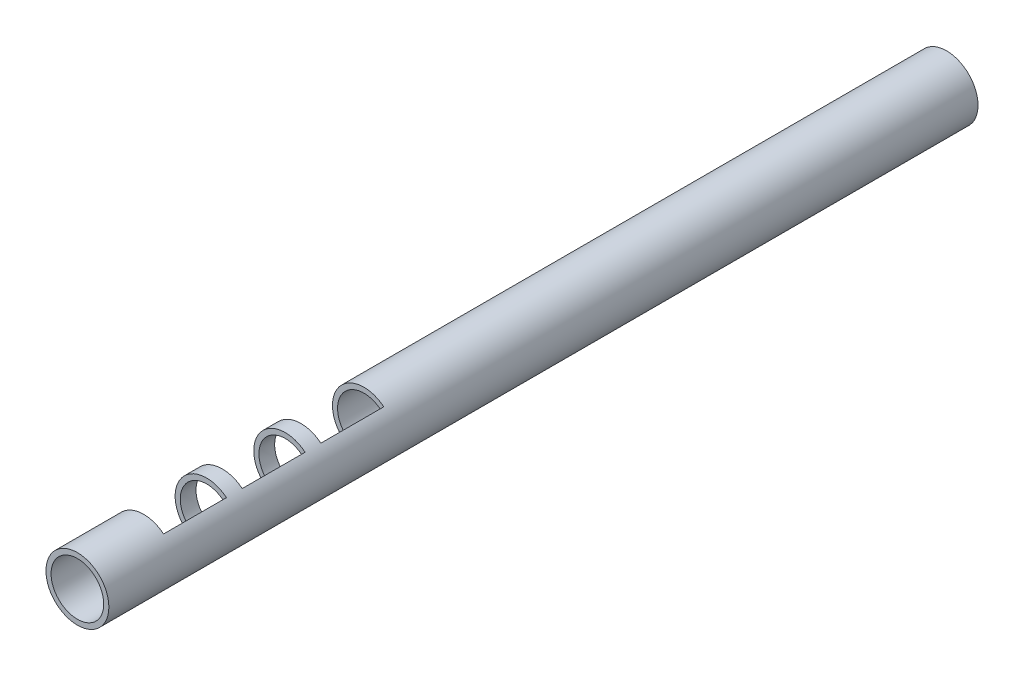
ISO-10303-21;
HEADER;
FILE_DESCRIPTION(('STEP AP214'),'2;1');
FILE_NAME('part.step','',(''),(''),'','','');
FILE_SCHEMA(('AUTOMOTIVE_DESIGN { 1 0 10303 214 1 1 1 1 }'));
ENDSEC;
DATA;
#1=APPLICATION_CONTEXT('core data for automotive mechanical design processes');
#2=APPLICATION_PROTOCOL_DEFINITION('international standard','automotive_design',2000,#1);
#3=PRODUCT_CONTEXT('',#1,'mechanical');
#4=PRODUCT('Part','Part','',(#3));
#5=PRODUCT_RELATED_PRODUCT_CATEGORY('part','',(#4));
#6=PRODUCT_DEFINITION_FORMATION('','',#4);
#7=PRODUCT_DEFINITION_CONTEXT('part definition',#1,'design');
#8=PRODUCT_DEFINITION('design','',#6,#7);
#9=PRODUCT_DEFINITION_SHAPE('','',#8);
#10=(LENGTH_UNIT() NAMED_UNIT(*) SI_UNIT(.MILLI.,.METRE.));
#11=(NAMED_UNIT(*) PLANE_ANGLE_UNIT() SI_UNIT($,.RADIAN.));
#12=(NAMED_UNIT(*) SI_UNIT($,.STERADIAN.) SOLID_ANGLE_UNIT());
#13=UNCERTAINTY_MEASURE_WITH_UNIT(LENGTH_MEASURE(1.E-05),#10,'distance_accuracy_value','');
#14=(GEOMETRIC_REPRESENTATION_CONTEXT(3) GLOBAL_UNCERTAINTY_ASSIGNED_CONTEXT((#13)) GLOBAL_UNIT_ASSIGNED_CONTEXT((#10,
#11,#12)) REPRESENTATION_CONTEXT('',''));
#15=CARTESIAN_POINT('',(0.,0.,0.));
#16=DIRECTION('',(0.,0.,1.));
#17=DIRECTION('',(1.,0.,0.));
#18=AXIS2_PLACEMENT_3D('',#15,#16,#17);
#19=CARTESIAN_POINT('',(0.393200000000001,0.481952030808046,2.488));
#20=DIRECTION('',(-0.774842493260524,0.632154340836013,0.));
#21=DIRECTION('',(0.,0.,1.));
#22=AXIS2_PLACEMENT_3D('',#19,#20,#21);
#23=PLANE('',#22);
#24=DIRECTION('',(0.632154340836013,0.774842493260524,0.));
#25=VECTOR('',#24,1.);
#26=CARTESIAN_POINT('',(0.393200000000001,0.481952030808046,1.866));
#27=LINE('',#26,#25);
#28=CARTESIAN_POINT('',(0.329108400000001,0.403393849786335,1.866));
#29=VERTEX_POINT('',#28);
#30=CARTESIAN_POINT('',(0.393200000000001,0.481952030808046,1.866));
#31=VERTEX_POINT('',#30);
#32=EDGE_CURVE('E11',#29,#31,#27,.T.);
#33=ORIENTED_EDGE('',*,*,#32,.F.);
#34=DIRECTION('',(0.,0.,1.));
#35=VECTOR('',#34,1.);
#36=CARTESIAN_POINT('',(0.329108400000001,0.403393849786335,1.555));
#37=LINE('',#36,#35);
#38=CARTESIAN_POINT('',(0.329108400000001,0.403393849786335,3.11));
#39=VERTEX_POINT('',#38);
#40=EDGE_CURVE('E293',#29,#39,#37,.T.);
#41=ORIENTED_EDGE('',*,*,#40,.T.);
#42=DIRECTION('',(0.632154340836013,0.774842493260524,0.));
#43=VECTOR('',#42,1.);
#44=CARTESIAN_POINT('',(0.393200000000001,0.481952030808046,3.11));
#45=LINE('',#44,#43);
#46=CARTESIAN_POINT('',(0.393200000000001,0.481952030808046,3.11));
#47=VERTEX_POINT('',#46);
#48=EDGE_CURVE('E48',#39,#47,#45,.T.);
#49=ORIENTED_EDGE('',*,*,#48,.T.);
#50=DIRECTION('',(0.,0.,1.));
#51=VECTOR('',#50,1.);
#52=CARTESIAN_POINT('',(0.393200000000001,0.481952030808046,1.555));
#53=LINE('',#52,#51);
#54=EDGE_CURVE('E283',#31,#47,#53,.T.);
#55=ORIENTED_EDGE('',*,*,#54,.F.);
#56=EDGE_LOOP('',(#33,#41,#49,#55));
#57=FACE_BOUND('',#56,.T.);
#58=ADVANCED_FACE('F40',(#57),#23,.T.);
#59=CARTESIAN_POINT('',(0.,0.,3.11));
#60=DIRECTION('',(0.,0.,1.));
#61=DIRECTION('',(1.,0.,0.));
#62=AXIS2_PLACEMENT_3D('',#59,#60,#61);
#63=PLANE('',#62);
#64=ORIENTED_EDGE('',*,*,#48,.F.);
#65=CARTESIAN_POINT('',(0.,0.,3.11));
#66=DIRECTION('',(0.,0.,1.));
#67=DIRECTION('',(1.,0.,0.));
#68=AXIS2_PLACEMENT_3D('',#65,#66,#67);
#69=CIRCLE('',#68,0.520614);
#70=CARTESIAN_POINT('',(0.329108400000001,-0.403393849786335,3.11));
#71=VERTEX_POINT('',#70);
#72=EDGE_CURVE('E290',#39,#71,#69,.T.);
#73=ORIENTED_EDGE('',*,*,#72,.T.);
#74=DIRECTION('',(0.632154340836013,-0.774842493260524,0.));
#75=VECTOR('',#74,1.);
#76=CARTESIAN_POINT('',(0.3932,-0.481952030808046,3.11));
#77=LINE('',#76,#75);
#78=CARTESIAN_POINT('',(0.3932,-0.481952030808046,3.11));
#79=VERTEX_POINT('',#78);
#80=EDGE_CURVE('E173',#71,#79,#77,.T.);
#81=ORIENTED_EDGE('',*,*,#80,.T.);
#82=CARTESIAN_POINT('',(0.,0.,3.11));
#83=DIRECTION('',(0.,0.,-1.));
#84=DIRECTION('',(-1.,0.,0.));
#85=AXIS2_PLACEMENT_3D('',#82,#83,#84);
#86=CIRCLE('',#85,0.622);
#87=EDGE_CURVE('E278',#47,#79,#86,.F.);
#88=ORIENTED_EDGE('',*,*,#87,.F.);
#89=EDGE_LOOP('',(#64,#73,#81,#88));
#90=FACE_BOUND('',#89,.T.);
#91=ADVANCED_FACE('F238',(#90),#63,.F.);
#92=CARTESIAN_POINT('',(0.,0.,3.421));
#93=DIRECTION('',(0.,0.,-1.));
#94=DIRECTION('',(-1.,0.,0.));
#95=AXIS2_PLACEMENT_3D('',#92,#93,#94);
#96=PLANE('',#95);
#97=DIRECTION('',(0.632154340836013,0.774842493260524,0.));
#98=VECTOR('',#97,1.);
#99=CARTESIAN_POINT('',(0.393200000000001,0.481952030808046,3.421));
#100=LINE('',#99,#98);
#101=CARTESIAN_POINT('',(0.329108400000001,0.403393849786335,3.421));
#102=VERTEX_POINT('',#101);
#103=CARTESIAN_POINT('',(0.393200000000001,0.481952030808046,3.421));
#104=VERTEX_POINT('',#103);
#105=EDGE_CURVE('E265',#102,#104,#100,.T.);
#106=ORIENTED_EDGE('',*,*,#105,.T.);
#107=CARTESIAN_POINT('',(0.,0.,3.421));
#108=DIRECTION('',(0.,0.,1.));
#109=DIRECTION('',(1.,0.,0.));
#110=AXIS2_PLACEMENT_3D('',#107,#108,#109);
#111=CIRCLE('',#110,0.622);
#112=CARTESIAN_POINT('',(0.393200000000001,-0.481952030808046,3.421));
#113=VERTEX_POINT('',#112);
#114=EDGE_CURVE('E279',#104,#113,#111,.T.);
#115=ORIENTED_EDGE('',*,*,#114,.T.);
#116=DIRECTION('',(0.632154340836013,-0.774842493260524,0.));
#117=VECTOR('',#116,1.);
#118=CARTESIAN_POINT('',(0.393200000000001,-0.481952030808046,3.421));
#119=LINE('',#118,#117);
#120=CARTESIAN_POINT('',(0.329108400000001,-0.403393849786335,3.421));
#121=VERTEX_POINT('',#120);
#122=EDGE_CURVE('E149',#121,#113,#119,.T.);
#123=ORIENTED_EDGE('',*,*,#122,.F.);
#124=CARTESIAN_POINT('',(0.,0.,3.421));
#125=DIRECTION('',(0.,0.,1.));
#126=DIRECTION('',(1.,0.,0.));
#127=AXIS2_PLACEMENT_3D('',#124,#125,#126);
#128=CIRCLE('',#127,0.520614);
#129=EDGE_CURVE('E276',#102,#121,#128,.T.);
#130=ORIENTED_EDGE('',*,*,#129,.F.);
#131=EDGE_LOOP('',(#106,#115,#123,#130));
#132=FACE_BOUND('',#131,.T.);
#133=ADVANCED_FACE('F243',(#132),#96,.F.);
#134=CARTESIAN_POINT('',(0.,0.,1.555));
#135=DIRECTION('',(0.,0.,-1.));
#136=DIRECTION('',(-1.,0.,0.));
#137=AXIS2_PLACEMENT_3D('',#134,#135,#136);
#138=PLANE('',#137);
#139=DIRECTION('',(0.632154340836013,0.774842493260524,0.));
#140=VECTOR('',#139,1.);
#141=CARTESIAN_POINT('',(0.3932,0.481952030808046,1.555));
#142=LINE('',#141,#140);
#143=CARTESIAN_POINT('',(0.3291084,0.403393849786335,1.555));
#144=VERTEX_POINT('',#143);
#145=CARTESIAN_POINT('',(0.3932,0.481952030808046,1.555));
#146=VERTEX_POINT('',#145);
#147=EDGE_CURVE('E252',#144,#146,#142,.T.);
#148=ORIENTED_EDGE('',*,*,#147,.F.);
#149=CARTESIAN_POINT('',(0.,0.,1.555));
#150=DIRECTION('',(0.,0.,1.));
#151=DIRECTION('',(1.,0.,0.));
#152=AXIS2_PLACEMENT_3D('',#149,#150,#151);
#153=CIRCLE('',#152,0.520614);
#154=CARTESIAN_POINT('',(0.3291084,-0.403393849786335,1.555));
#155=VERTEX_POINT('',#154);
#156=EDGE_CURVE('E254',#144,#155,#153,.T.);
#157=ORIENTED_EDGE('',*,*,#156,.T.);
#158=DIRECTION('',(0.632154340836013,-0.774842493260524,0.));
#159=VECTOR('',#158,1.);
#160=CARTESIAN_POINT('',(0.3932,-0.481952030808046,1.555));
#161=LINE('',#160,#159);
#162=CARTESIAN_POINT('',(0.3932,-0.481952030808046,1.555));
#163=VERTEX_POINT('',#162);
#164=EDGE_CURVE('E162',#155,#163,#161,.T.);
#165=ORIENTED_EDGE('',*,*,#164,.T.);
#166=CARTESIAN_POINT('',(0.,0.,1.555));
#167=DIRECTION('',(0.,0.,1.));
#168=DIRECTION('',(1.,0.,0.));
#169=AXIS2_PLACEMENT_3D('',#166,#167,#168);
#170=CIRCLE('',#169,0.622);
#171=EDGE_CURVE('E63',#146,#163,#170,.T.);
#172=ORIENTED_EDGE('',*,*,#171,.F.);
#173=EDGE_LOOP('',(#148,#157,#165,#172));
#174=FACE_BOUND('',#173,.T.);
#175=ADVANCED_FACE('F234',(#174),#138,.T.);
#176=CARTESIAN_POINT('',(0.,0.,1.866));
#177=DIRECTION('',(0.,0.,-1.));
#178=DIRECTION('',(-1.,0.,0.));
#179=AXIS2_PLACEMENT_3D('',#176,#177,#178);
#180=PLANE('',#179);
#181=CARTESIAN_POINT('',(0.,0.,1.866));
#182=DIRECTION('',(0.,0.,1.));
#183=DIRECTION('',(1.,0.,0.));
#184=AXIS2_PLACEMENT_3D('',#181,#182,#183);
#185=CIRCLE('',#184,0.520614);
#186=CARTESIAN_POINT('',(0.329108400000001,-0.403393849786335,1.866));
#187=VERTEX_POINT('',#186);
#188=EDGE_CURVE('E281',#187,#29,#185,.F.);
#189=ORIENTED_EDGE('',*,*,#188,.T.);
#190=ORIENTED_EDGE('',*,*,#32,.T.);
#191=CARTESIAN_POINT('',(0.,0.,1.866));
#192=DIRECTION('',(0.,0.,1.));
#193=DIRECTION('',(1.,0.,0.));
#194=AXIS2_PLACEMENT_3D('',#191,#192,#193);
#195=CIRCLE('',#194,0.622);
#196=CARTESIAN_POINT('',(0.3932,-0.481952030808046,1.866));
#197=VERTEX_POINT('',#196);
#198=EDGE_CURVE('E286',#197,#31,#195,.F.);
#199=ORIENTED_EDGE('',*,*,#198,.F.);
#200=DIRECTION('',(0.632154340836013,-0.774842493260524,0.));
#201=VECTOR('',#200,1.);
#202=CARTESIAN_POINT('',(0.3932,-0.481952030808046,1.866));
#203=LINE('',#202,#201);
#204=EDGE_CURVE('E178',#187,#197,#203,.T.);
#205=ORIENTED_EDGE('',*,*,#204,.F.);
#206=EDGE_LOOP('',(#189,#190,#199,#205));
#207=FACE_BOUND('',#206,.T.);
#208=ADVANCED_FACE('F42',(#207),#180,.F.);
#209=CARTESIAN_POINT('',(0.,0.,1.555));
#210=DIRECTION('',(0.,0.,1.));
#211=DIRECTION('',(1.,0.,0.));
#212=AXIS2_PLACEMENT_3D('',#209,#210,#211);
#213=CYLINDRICAL_SURFACE('',#212,0.622);
#214=CARTESIAN_POINT('',(-0.622,0.,5.365));
#215=CARTESIAN_POINT('',(-0.621999577929827,0.0109193633288384,5.36499939308507));
#216=CARTESIAN_POINT('',(-0.621709329938002,0.0218502270294628,5.36410161503432));
#217=CARTESIAN_POINT('',(-0.620578112855119,0.043402443202015,5.36054010866013));
#218=CARTESIAN_POINT('',(-0.619736207669612,0.0540232374685384,5.35787337854731));
#219=CARTESIAN_POINT('',(-0.617593869971351,0.0746246518911457,5.35087419082279));
#220=CARTESIAN_POINT('',(-0.61629445041236,0.0846066291781811,5.34654541114978));
#221=CARTESIAN_POINT('',(-0.613370888019472,0.103699386181399,5.33635803819557));
#222=CARTESIAN_POINT('',(-0.61174679129765,0.112810289340036,5.33049966211826));
#223=CARTESIAN_POINT('',(-0.608286102372987,0.130203719158426,5.31721765206123));
#224=CARTESIAN_POINT('',(-0.606444663928166,0.138453985198494,5.30975303528527));
#225=CARTESIAN_POINT('',(-0.602784240920798,0.153610144329198,5.29355730894605));
#226=CARTESIAN_POINT('',(-0.600965262165017,0.160515696300347,5.28482587900247));
#227=CARTESIAN_POINT('',(-0.597503530771228,0.172963818804697,5.26606209326497));
#228=CARTESIAN_POINT('',(-0.595866696764658,0.178465603211153,5.25600148309368));
#229=CARTESIAN_POINT('',(-0.59302745289626,0.187685596399211,5.23503670826931));
#230=CARTESIAN_POINT('',(-0.591824918677886,0.191404315840203,5.22413278617599));
#231=CARTESIAN_POINT('',(-0.590041030843826,0.196833859126492,5.20215455937567));
#232=CARTESIAN_POINT('',(-0.589441214579351,0.198604530142794,5.19109658086054));
#233=CARTESIAN_POINT('',(-0.588875945894283,0.200274737992444,5.16882547613999));
#234=CARTESIAN_POINT('',(-0.588910313539342,0.200174805564169,5.15761239484344));
#235=CARTESIAN_POINT('',(-0.589593281584499,0.198153311328795,5.13585096574481));
#236=CARTESIAN_POINT('',(-0.590215937903085,0.196308688318,5.12529451770902));
#237=CARTESIAN_POINT('',(-0.591963052928186,0.190975230611652,5.10464966713253));
#238=CARTESIAN_POINT('',(-0.593087570309906,0.187486203657547,5.09456131947219));
#239=CARTESIAN_POINT('',(-0.595731017518543,0.178910257031213,5.07495920845102));
#240=CARTESIAN_POINT('',(-0.597255714099061,0.173799725062295,5.06545658672679));
#241=CARTESIAN_POINT('',(-0.600525069528976,0.162142523518303,5.0474194725291));
#242=CARTESIAN_POINT('',(-0.602269776064023,0.155595542374402,5.0388851907008));
#243=CARTESIAN_POINT('',(-0.605885585651293,0.140878299077213,5.02259381155107));
#244=CARTESIAN_POINT('',(-0.607758727443434,0.132645000236177,5.01489400937032));
#245=CARTESIAN_POINT('',(-0.611347152244487,0.114977401877551,5.0009672538188));
#246=CARTESIAN_POINT('',(-0.613062366497891,0.105542583485076,4.9947409401126));
#247=CARTESIAN_POINT('',(-0.616161845004992,0.0856218640392364,4.98389576386483));
#248=CARTESIAN_POINT('',(-0.617542856982662,0.0751269410421367,4.97929251303983));
#249=CARTESIAN_POINT('',(-0.619792686366072,0.0534683769053928,4.9719420636265));
#250=CARTESIAN_POINT('',(-0.620662554643341,0.0423061601262106,4.96919105526121));
#251=CARTESIAN_POINT('',(-0.62148320570485,0.025868383558992,4.96661195013316));
#252=CARTESIAN_POINT('',(-0.621676438455422,0.020715991613797,4.966008193597));
#253=CARTESIAN_POINT('',(-0.621934936052818,0.0103765990587502,4.96520207383045));
#254=CARTESIAN_POINT('',(-0.62200020059546,0.00518959836666256,4.96499971155417));
#255=CARTESIAN_POINT('',(-0.621999577929833,-0.0109193633288352,4.96500060691491));
#256=CARTESIAN_POINT('',(-0.621709329938004,-0.0218502270294587,4.96589838496567));
#257=CARTESIAN_POINT('',(-0.620578112855117,-0.0434024432020111,4.96945989133987));
#258=CARTESIAN_POINT('',(-0.619736207669612,-0.0540232374685353,4.97212662145269));
#259=CARTESIAN_POINT('',(-0.617593869971351,-0.0746246518911438,4.97912580917721));
#260=CARTESIAN_POINT('',(-0.616294450412361,-0.0846066291781794,4.98345458885022));
#261=CARTESIAN_POINT('',(-0.613370888019472,-0.103699386181397,4.99364196180443));
#262=CARTESIAN_POINT('',(-0.611746791297651,-0.112810289340035,4.99950033788174));
#263=CARTESIAN_POINT('',(-0.608286102372988,-0.130203719158423,5.01278234793877));
#264=CARTESIAN_POINT('',(-0.606444663928166,-0.138453985198492,5.02024696471472));
#265=CARTESIAN_POINT('',(-0.602784240920798,-0.153610144329196,5.03644269105395));
#266=CARTESIAN_POINT('',(-0.600965262165017,-0.160515696300345,5.04517412099753));
#267=CARTESIAN_POINT('',(-0.597503530771229,-0.172963818804695,5.06393790673503));
#268=CARTESIAN_POINT('',(-0.595866696764659,-0.178465603211152,5.07399851690632));
#269=CARTESIAN_POINT('',(-0.59302745289626,-0.187685596399211,5.09496329173069));
#270=CARTESIAN_POINT('',(-0.591824918677886,-0.191404315840202,5.10586721382401));
#271=CARTESIAN_POINT('',(-0.590041030843827,-0.196833859126491,5.12784544062432));
#272=CARTESIAN_POINT('',(-0.589441214579351,-0.198604530142794,5.13890341913945));
#273=CARTESIAN_POINT('',(-0.588875945894283,-0.200274737992444,5.16117452386001));
#274=CARTESIAN_POINT('',(-0.588910313539342,-0.200174805564169,5.17238760515656));
#275=CARTESIAN_POINT('',(-0.589593281584499,-0.198153311328795,5.19414903425519));
#276=CARTESIAN_POINT('',(-0.590215937903085,-0.196308688318,5.20470548229097));
#277=CARTESIAN_POINT('',(-0.591963052928186,-0.190975230611653,5.22535033286746));
#278=CARTESIAN_POINT('',(-0.593087570309906,-0.187486203657547,5.2354386805278));
#279=CARTESIAN_POINT('',(-0.595731017518542,-0.178910257031214,5.25504079154898));
#280=CARTESIAN_POINT('',(-0.597255714099061,-0.173799725062295,5.26454341327321));
#281=CARTESIAN_POINT('',(-0.600525069528976,-0.162142523518304,5.2825805274709));
#282=CARTESIAN_POINT('',(-0.602269776064022,-0.155595542374403,5.29111480929919));
#283=CARTESIAN_POINT('',(-0.605885585651293,-0.140878299077215,5.30740618844893));
#284=CARTESIAN_POINT('',(-0.607758727443433,-0.132645000236179,5.31510599062967));
#285=CARTESIAN_POINT('',(-0.611347152244487,-0.114977401877553,5.3290327461812));
#286=CARTESIAN_POINT('',(-0.61306236649789,-0.105542583485078,5.3352590598874));
#287=CARTESIAN_POINT('',(-0.616161845004992,-0.0856218640392379,5.34610423613517));
#288=CARTESIAN_POINT('',(-0.617542856982662,-0.0751269410421379,5.35070748696017));
#289=CARTESIAN_POINT('',(-0.619792686366072,-0.0534683769053939,5.3580579363735));
#290=CARTESIAN_POINT('',(-0.62066255464334,-0.042306160126212,5.36080894473879));
#291=CARTESIAN_POINT('',(-0.62148320570485,-0.0258683835589934,5.36338804986684));
#292=CARTESIAN_POINT('',(-0.621676438455423,-0.0207159916137979,5.363991806403));
#293=CARTESIAN_POINT('',(-0.621934936052818,-0.0103765990587498,5.36479792616955));
#294=CARTESIAN_POINT('',(-0.622000200595457,-0.00518959836666111,5.36500028844582));
#295=CARTESIAN_POINT('',(-0.622,0.,5.365));
#296=B_SPLINE_CURVE_WITH_KNOTS('',3,(#214,#215,#216,#217,#218,#219,#220,#221,#222,#223,#224,
#225,#226,#227,#228,#229,#230,#231,#232,#233,#234,#235,#236,#237,#238,#239,#240,#241,#242,#243,
#244,#245,#246,#247,#248,#249,#250,#251,#252,#253,#254,#255,#256,#257,#258,#259,#260,#261,#262,
#263,#264,#265,#266,#267,#268,#269,#270,#271,#272,#273,#274,#275,#276,#277,#278,#279,#280,#281,
#282,#283,#284,#285,#286,#287,#288,#289,#290,#291,#292,#293,#294,#295),.UNSPECIFIED.,.T.,.F.,(4,
2,2,2,2,2,2,2,2,2,2,2,2,2,2,2,2,2,2,2,2,2,2,2,2,2,2,2,2,2,2,2,2,2,2,2,2,2,2,2,4),(0.,
0.0327380856553519,0.065531868183564,0.0982534959600799,0.130970479764623,0.16465009229773,
0.198338237386977,0.232915564706205,0.26748298335722,0.300955906343576,0.334419332343535,
0.366472648404575,0.398529712968828,0.431076848275395,0.463631050114923,0.497754520395143,
0.531892777149168,0.566350973681965,0.600738076718819,0.61629732746276,0.631856615191184,
0.664594700846535,0.697388483374749,0.730110111151266,0.762827094955808,0.796506707488914,
0.830194852578161,0.864772179897391,0.899339598548406,0.932812521534762,0.96627594753472,
0.998329263595761,1.03038632816001,1.06293346346658,1.09548766530611,1.12961113558633,
1.16374939234035,1.19820758887315,1.23259469191,1.24815394265395,1.26371323038237),.UNSPECIFIED.);
#297=CARTESIAN_POINT('',(-0.622,0.,5.365));
#298=VERTEX_POINT('',#297);
#299=EDGE_CURVE('E188',#298,#298,#296,.T.);
#300=ORIENTED_EDGE('',*,*,#299,.F.);
#301=EDGE_LOOP('',(#300));
#302=FACE_BOUND('',#301,.T.);
#303=DIRECTION('',(0.,0.,1.));
#304=VECTOR('',#303,1.);
#305=CARTESIAN_POINT('',(0.393200000000001,-0.481952030808046,3.11));
#306=LINE('',#305,#304);
#307=CARTESIAN_POINT('',(0.393200000000001,-0.481952030808046,4.665));
#308=VERTEX_POINT('',#307);
#309=EDGE_CURVE('E137',#113,#308,#306,.T.);
#310=ORIENTED_EDGE('',*,*,#309,.F.);
#311=ORIENTED_EDGE('',*,*,#114,.F.);
#312=DIRECTION('',(0.,0.,1.));
#313=VECTOR('',#312,1.);
#314=CARTESIAN_POINT('',(0.393200000000001,0.481952030808046,3.11));
#315=LINE('',#314,#313);
#316=CARTESIAN_POINT('',(0.393200000000001,0.481952030808046,4.665));
#317=VERTEX_POINT('',#316);
#318=EDGE_CURVE('E139',#104,#317,#315,.T.);
#319=ORIENTED_EDGE('',*,*,#318,.T.);
#320=CARTESIAN_POINT('',(0.,0.,4.665));
#321=DIRECTION('',(0.,0.,-1.));
#322=DIRECTION('',(-1.,0.,0.));
#323=AXIS2_PLACEMENT_3D('',#320,#321,#322);
#324=CIRCLE('',#323,0.622);
#325=EDGE_CURVE('E131',#317,#308,#324,.F.);
#326=ORIENTED_EDGE('',*,*,#325,.T.);
#327=EDGE_LOOP('',(#310,#311,#319,#326));
#328=FACE_BOUND('',#327,.T.);
#329=CARTESIAN_POINT('',(0.,0.,5.976));
#330=DIRECTION('',(0.,0.,1.));
#331=DIRECTION('',(1.,0.,0.));
#332=AXIS2_PLACEMENT_3D('',#329,#330,#331);
#333=CIRCLE('',#332,0.622);
#334=CARTESIAN_POINT('',(0.622,0.,5.976));
#335=VERTEX_POINT('',#334);
#336=EDGE_CURVE('E529',#335,#335,#333,.T.);
#337=ORIENTED_EDGE('',*,*,#336,.F.);
#338=EDGE_LOOP('',(#337));
#339=FACE_BOUND('',#338,.T.);
#340=DIRECTION('',(0.,0.,1.));
#341=VECTOR('',#340,1.);
#342=CARTESIAN_POINT('',(0.3932,-0.481952030808046,1.555));
#343=LINE('',#342,#341);
#344=EDGE_CURVE('E170',#197,#79,#343,.T.);
#345=ORIENTED_EDGE('',*,*,#344,.F.);
#346=ORIENTED_EDGE('',*,*,#198,.T.);
#347=ORIENTED_EDGE('',*,*,#54,.T.);
#348=ORIENTED_EDGE('',*,*,#87,.T.);
#349=EDGE_LOOP('',(#345,#346,#347,#348));
#350=FACE_BOUND('',#349,.T.);
#351=DIRECTION('',(0.,0.,1.));
#352=VECTOR('',#351,1.);
#353=CARTESIAN_POINT('',(0.3932,-0.481952030808046,0.));
#354=LINE('',#353,#352);
#355=CARTESIAN_POINT('',(0.3932,-0.481952030808046,0.311));
#356=VERTEX_POINT('',#355);
#357=EDGE_CURVE('E159',#356,#163,#354,.T.);
#358=ORIENTED_EDGE('',*,*,#357,.F.);
#359=CARTESIAN_POINT('',(0.,0.,0.311));
#360=DIRECTION('',(0.,0.,1.));
#361=DIRECTION('',(1.,0.,0.));
#362=AXIS2_PLACEMENT_3D('',#359,#360,#361);
#363=CIRCLE('',#362,0.622);
#364=CARTESIAN_POINT('',(0.3932,0.481952030808046,0.311));
#365=VERTEX_POINT('',#364);
#366=EDGE_CURVE('E258',#356,#365,#363,.F.);
#367=ORIENTED_EDGE('',*,*,#366,.T.);
#368=DIRECTION('',(0.,0.,1.));
#369=VECTOR('',#368,1.);
#370=CARTESIAN_POINT('',(0.3932,0.481952030808046,0.));
#371=LINE('',#370,#369);
#372=EDGE_CURVE('E267',#365,#146,#371,.T.);
#373=ORIENTED_EDGE('',*,*,#372,.T.);
#374=ORIENTED_EDGE('',*,*,#171,.T.);
#375=EDGE_LOOP('',(#358,#367,#373,#374));
#376=FACE_BOUND('',#375,.T.);
#377=CARTESIAN_POINT('',(0.,0.,-11.21));
#378=DIRECTION('',(0.,0.,-1.));
#379=DIRECTION('',(-1.,0.,0.));
#380=AXIS2_PLACEMENT_3D('',#377,#378,#379);
#381=CIRCLE('',#380,0.622);
#382=CARTESIAN_POINT('',(-0.622,0.,-11.21));
#383=VERTEX_POINT('',#382);
#384=EDGE_CURVE('E314',#383,#383,#381,.T.);
#385=ORIENTED_EDGE('',*,*,#384,.F.);
#386=EDGE_LOOP('',(#385));
#387=FACE_BOUND('',#386,.T.);
#388=ADVANCED_FACE('F133',(#302,#328,#339,#350,#376,#387),#213,.T.);
#389=CARTESIAN_POINT('',(0.,0.,1.555));
#390=DIRECTION('',(0.,0.,1.));
#391=DIRECTION('',(1.,0.,0.));
#392=AXIS2_PLACEMENT_3D('',#389,#390,#391);
#393=CYLINDRICAL_SURFACE('',#392,0.520614);
#394=CARTESIAN_POINT('',(-0.520614,0.,5.365));
#395=CARTESIAN_POINT('',(-0.520613514689114,0.0107956701120088,5.36499937381276));
#396=CARTESIAN_POINT('',(-0.520274634314804,0.0216012044258958,5.36412169078187));
#397=CARTESIAN_POINT('',(-0.518953603242681,0.0429001093390013,5.36064353234449));
#398=CARTESIAN_POINT('',(-0.517970491559685,0.0533929890741568,5.35804048318187));
#399=CARTESIAN_POINT('',(-0.515467170996156,0.073738227431799,5.35121886699427));
#400=CARTESIAN_POINT('',(-0.513948400366225,0.0835922184170895,5.34700462352429));
#401=CARTESIAN_POINT('',(-0.510524407794475,0.102448673096472,5.3370981675949));
#402=CARTESIAN_POINT('',(-0.508619200560733,0.111451169180001,5.33140601138369));
#403=CARTESIAN_POINT('',(-0.504523374923857,0.128752900072885,5.3184411156542));
#404=CARTESIAN_POINT('',(-0.502324385367266,0.137009567903274,5.31111423454273));
#405=CARTESIAN_POINT('',(-0.497928940551434,0.152211856034186,5.29520255463404));
#406=CARTESIAN_POINT('',(-0.495732486539278,0.159156987475636,5.2866172888989));
#407=CARTESIAN_POINT('',(-0.4914925845933,0.171815042363857,5.26801064474767));
#408=CARTESIAN_POINT('',(-0.489458890180966,0.177466918989746,5.2579452888811));
#409=CARTESIAN_POINT('',(-0.485905241196104,0.186978631328273,5.23691659564903));
#410=CARTESIAN_POINT('',(-0.484385069683624,0.190839224034607,5.22595363991631));
#411=CARTESIAN_POINT('',(-0.482120130764399,0.196489388722503,5.203930258725));
#412=CARTESIAN_POINT('',(-0.481345075675259,0.198360218476035,5.19289390331718));
#413=CARTESIAN_POINT('',(-0.480569780928279,0.200231751889377,5.17063878623134));
#414=CARTESIAN_POINT('',(-0.480569199721745,0.200233279925004,5.1594201071423));
#415=CARTESIAN_POINT('',(-0.481316904110774,0.198428100816448,5.13787534382539));
#416=CARTESIAN_POINT('',(-0.482017784666322,0.196735858737025,5.12753771324575));
#417=CARTESIAN_POINT('',(-0.484010379390151,0.191780980630058,5.10730628041781));
#418=CARTESIAN_POINT('',(-0.485302189169174,0.188518090471457,5.09741255027597));
#419=CARTESIAN_POINT('',(-0.488358502567815,0.180454276834374,5.07812245420864));
#420=CARTESIAN_POINT('',(-0.490131736000886,0.175624590747233,5.06873955628492));
#421=CARTESIAN_POINT('',(-0.493948271745926,0.164584589481138,5.05088526995001));
#422=CARTESIAN_POINT('',(-0.495991658494738,0.158373842233772,5.04241416803002));
#423=CARTESIAN_POINT('',(-0.500294452493576,0.144231468047008,5.02599345908577));
#424=CARTESIAN_POINT('',(-0.502558920556002,0.136209242537718,5.018123017015));
#425=CARTESIAN_POINT('',(-0.506925822119937,0.118930527519278,5.00381254534915));
#426=CARTESIAN_POINT('',(-0.509028179284183,0.109673462063507,4.99737318699076));
#427=CARTESIAN_POINT('',(-0.512879961730973,0.0899750494078043,4.98601390020554));
#428=CARTESIAN_POINT('',(-0.51462252956897,0.0795157371428972,4.98112268638634));
#429=CARTESIAN_POINT('',(-0.51750471262191,0.0578491298274882,4.97320339231079));
#430=CARTESIAN_POINT('',(-0.518645543355978,0.0466433945676833,4.97017155405159));
#431=CARTESIAN_POINT('',(-0.519813743081124,0.029441167770076,4.96709050817924));
#432=CARTESIAN_POINT('',(-0.520112792421215,0.0235854149281415,4.9663077511314));
#433=CARTESIAN_POINT('',(-0.520513053270645,0.0118207605769446,4.96526232687946));
#434=CARTESIAN_POINT('',(-0.520614265763031,0.00591185933192195,4.96499965709107));
#435=CARTESIAN_POINT('',(-0.520613514689164,-0.010795670111983,4.96500062618711));
#436=CARTESIAN_POINT('',(-0.520274634314819,-0.0216012044258642,4.96587830921809));
#437=CARTESIAN_POINT('',(-0.51895360324267,-0.0429001093389702,4.96935646765554));
#438=CARTESIAN_POINT('',(-0.517970491559684,-0.0533929890741318,4.97195951681814));
#439=CARTESIAN_POINT('',(-0.515467170996162,-0.0737382274317821,4.97878113300571));
#440=CARTESIAN_POINT('',(-0.513948400366228,-0.0835922184170746,4.9829953764757));
#441=CARTESIAN_POINT('',(-0.510524407794477,-0.102448673096457,4.99290183240509));
#442=CARTESIAN_POINT('',(-0.508619200560736,-0.111451169179985,4.9985939886163));
#443=CARTESIAN_POINT('',(-0.504523374923862,-0.128752900072867,5.01155888434579));
#444=CARTESIAN_POINT('',(-0.502324385367271,-0.137009567903256,5.01888576545725));
#445=CARTESIAN_POINT('',(-0.497928940551438,-0.15221185603417,5.03479744536594));
#446=CARTESIAN_POINT('',(-0.495732486539283,-0.159156987475622,5.04338271110108));
#447=CARTESIAN_POINT('',(-0.491492584593304,-0.171815042363845,5.06198935525231));
#448=CARTESIAN_POINT('',(-0.48945889018097,-0.177466918989735,5.07205471111888));
#449=CARTESIAN_POINT('',(-0.485905241196107,-0.186978631328265,5.09308340435095));
#450=CARTESIAN_POINT('',(-0.484385069683627,-0.1908392240346,5.10404636008366));
#451=CARTESIAN_POINT('',(-0.482120130764401,-0.196489388722499,5.12606974127498));
#452=CARTESIAN_POINT('',(-0.481345075675261,-0.198360218476032,5.1371060966828));
#453=CARTESIAN_POINT('',(-0.480569780928279,-0.200231751889377,5.15936121376863));
#454=CARTESIAN_POINT('',(-0.480569199721745,-0.200233279925005,5.17057989285767));
#455=CARTESIAN_POINT('',(-0.481316904110773,-0.198428100816451,5.19212465617458));
#456=CARTESIAN_POINT('',(-0.48201778466632,-0.196735858737029,5.20246228675423));
#457=CARTESIAN_POINT('',(-0.484010379390149,-0.191780980630064,5.22269371958216));
#458=CARTESIAN_POINT('',(-0.485302189169171,-0.188518090471464,5.23258744972401));
#459=CARTESIAN_POINT('',(-0.488358502567812,-0.180454276834382,5.25187754579134));
#460=CARTESIAN_POINT('',(-0.490131736000883,-0.175624590747242,5.26126044371506));
#461=CARTESIAN_POINT('',(-0.493948271745923,-0.164584589481149,5.27911473004997));
#462=CARTESIAN_POINT('',(-0.495991658494734,-0.158373842233784,5.28758583196996));
#463=CARTESIAN_POINT('',(-0.500294452493571,-0.144231468047023,5.30400654091421));
#464=CARTESIAN_POINT('',(-0.502558920555997,-0.136209242537736,5.31187698298498));
#465=CARTESIAN_POINT('',(-0.506925822119932,-0.118930527519299,5.32618745465084));
#466=CARTESIAN_POINT('',(-0.509028179284178,-0.109673462063528,5.33262681300923));
#467=CARTESIAN_POINT('',(-0.512879961730971,-0.0899750494078233,5.34398609979445));
#468=CARTESIAN_POINT('',(-0.514622529568969,-0.0795157371429141,5.34887731361366));
#469=CARTESIAN_POINT('',(-0.517504712621907,-0.0578491298275051,5.3567966076892));
#470=CARTESIAN_POINT('',(-0.518645543355971,-0.0466433945677026,5.35982844594839));
#471=CARTESIAN_POINT('',(-0.519813743081125,-0.0294411677700941,5.36290949182077));
#472=CARTESIAN_POINT('',(-0.520112792421223,-0.023585414928155,5.36369224886862));
#473=CARTESIAN_POINT('',(-0.520513053270637,-0.011820760576944,5.36473767312052));
#474=CARTESIAN_POINT('',(-0.520614265763001,-0.00591185933191171,5.36500034290886));
#475=CARTESIAN_POINT('',(-0.520614,0.,5.365));
#476=B_SPLINE_CURVE_WITH_KNOTS('',3,(#394,#395,#396,#397,#398,#399,#400,#401,#402,#403,#404,
#405,#406,#407,#408,#409,#410,#411,#412,#413,#414,#415,#416,#417,#418,#419,#420,#421,#422,#423,
#424,#425,#426,#427,#428,#429,#430,#431,#432,#433,#434,#435,#436,#437,#438,#439,#440,#441,#442,
#443,#444,#445,#446,#447,#448,#449,#450,#451,#452,#453,#454,#455,#456,#457,#458,#459,#460,#461,
#462,#463,#464,#465,#466,#467,#468,#469,#470,#471,#472,#473,#474,#475),.UNSPECIFIED.,.T.,.F.,(4,
2,2,2,2,2,2,2,2,2,2,2,2,2,2,2,2,2,2,2,2,2,2,2,2,2,2,2,2,2,2,2,2,2,2,2,2,2,2,2,4),(0.,
0.0323640931706411,0.064776573354208,0.0971026799981974,0.129427556516403,0.163046166797803,
0.196677283375778,0.231665785134983,0.266639487312473,0.300122540074218,0.333590826557912,
0.364940387240171,0.396295021991102,0.428261331555217,0.460237655964198,0.494473823824758,
0.528726016113178,0.563580615113041,0.598364534951794,0.616087651254464,0.633810679491186,
0.666174772661821,0.698587252845402,0.730913359489398,0.763238236007596,0.796856846288992,
0.83048796286697,0.865476464626175,0.900450166803664,0.93393321956541,0.967401506049105,
0.998751066731365,1.0301057014823,1.06207201104641,1.09404833545539,1.12828450331595,
1.16253669560437,1.19739129460424,1.23217521444299,1.24989833074567,1.26762135898242),.UNSPECIFIED.);
#477=CARTESIAN_POINT('',(-0.520614,0.,5.365));
#478=VERTEX_POINT('',#477);
#479=EDGE_CURVE('E181',#478,#478,#476,.T.);
#480=ORIENTED_EDGE('',*,*,#479,.T.);
#481=EDGE_LOOP('',(#480));
#482=FACE_BOUND('',#481,.T.);
#483=ORIENTED_EDGE('',*,*,#129,.T.);
#484=DIRECTION('',(0.,0.,1.));
#485=VECTOR('',#484,1.);
#486=CARTESIAN_POINT('',(0.329108400000001,-0.403393849786335,3.11));
#487=LINE('',#486,#485);
#488=CARTESIAN_POINT('',(0.329108400000001,-0.403393849786335,4.665));
#489=VERTEX_POINT('',#488);
#490=EDGE_CURVE('E153',#121,#489,#487,.T.);
#491=ORIENTED_EDGE('',*,*,#490,.T.);
#492=CARTESIAN_POINT('',(0.,0.,4.665));
#493=DIRECTION('',(0.,0.,1.));
#494=DIRECTION('',(1.,0.,0.));
#495=AXIS2_PLACEMENT_3D('',#492,#493,#494);
#496=CIRCLE('',#495,0.520614);
#497=CARTESIAN_POINT('',(0.329108400000001,0.403393849786335,4.665));
#498=VERTEX_POINT('',#497);
#499=EDGE_CURVE('E145',#498,#489,#496,.T.);
#500=ORIENTED_EDGE('',*,*,#499,.F.);
#501=DIRECTION('',(0.,0.,1.));
#502=VECTOR('',#501,1.);
#503=CARTESIAN_POINT('',(0.329108400000001,0.403393849786335,3.11));
#504=LINE('',#503,#502);
#505=EDGE_CURVE('E55',#102,#498,#504,.T.);
#506=ORIENTED_EDGE('',*,*,#505,.F.);
#507=EDGE_LOOP('',(#483,#491,#500,#506));
#508=FACE_BOUND('',#507,.T.);
#509=CARTESIAN_POINT('',(0.,0.,5.976));
#510=DIRECTION('',(0.,0.,-1.));
#511=DIRECTION('',(1.,0.,0.));
#512=AXIS2_PLACEMENT_3D('',#509,#510,#511);
#513=CIRCLE('',#512,0.520614);
#514=CARTESIAN_POINT('',(0.520614,0.,5.976));
#515=VERTEX_POINT('',#514);
#516=EDGE_CURVE('E318',#515,#515,#513,.T.);
#517=ORIENTED_EDGE('',*,*,#516,.F.);
#518=EDGE_LOOP('',(#517));
#519=FACE_BOUND('',#518,.T.);
#520=ORIENTED_EDGE('',*,*,#188,.F.);
#521=DIRECTION('',(0.,0.,1.));
#522=VECTOR('',#521,1.);
#523=CARTESIAN_POINT('',(0.329108400000001,-0.403393849786335,1.555));
#524=LINE('',#523,#522);
#525=EDGE_CURVE('E169',#187,#71,#524,.T.);
#526=ORIENTED_EDGE('',*,*,#525,.T.);
#527=ORIENTED_EDGE('',*,*,#72,.F.);
#528=ORIENTED_EDGE('',*,*,#40,.F.);
#529=EDGE_LOOP('',(#520,#526,#527,#528));
#530=FACE_BOUND('',#529,.T.);
#531=CARTESIAN_POINT('',(0.,0.,0.311));
#532=DIRECTION('',(0.,0.,1.));
#533=DIRECTION('',(1.,0.,0.));
#534=AXIS2_PLACEMENT_3D('',#531,#532,#533);
#535=CIRCLE('',#534,0.520614);
#536=CARTESIAN_POINT('',(0.3291084,-0.403393849786335,0.311));
#537=VERTEX_POINT('',#536);
#538=CARTESIAN_POINT('',(0.3291084,0.403393849786335,0.311));
#539=VERTEX_POINT('',#538);
#540=EDGE_CURVE('E264',#537,#539,#535,.F.);
#541=ORIENTED_EDGE('',*,*,#540,.F.);
#542=DIRECTION('',(0.,0.,1.));
#543=VECTOR('',#542,1.);
#544=CARTESIAN_POINT('',(0.3291084,-0.403393849786335,0.));
#545=LINE('',#544,#543);
#546=EDGE_CURVE('E158',#537,#155,#545,.T.);
#547=ORIENTED_EDGE('',*,*,#546,.T.);
#548=ORIENTED_EDGE('',*,*,#156,.F.);
#549=DIRECTION('',(0.,0.,1.));
#550=VECTOR('',#549,1.);
#551=CARTESIAN_POINT('',(0.3291084,0.403393849786335,0.));
#552=LINE('',#551,#550);
#553=EDGE_CURVE('E261',#539,#144,#552,.T.);
#554=ORIENTED_EDGE('',*,*,#553,.F.);
#555=EDGE_LOOP('',(#541,#547,#548,#554));
#556=FACE_BOUND('',#555,.T.);
#557=CARTESIAN_POINT('',(0.,0.,-11.21));
#558=DIRECTION('',(0.,0.,1.));
#559=DIRECTION('',(-1.,0.,0.));
#560=AXIS2_PLACEMENT_3D('',#557,#558,#559);
#561=CIRCLE('',#560,0.520614);
#562=CARTESIAN_POINT('',(-0.520614,0.,-11.21));
#563=VERTEX_POINT('',#562);
#564=EDGE_CURVE('E313',#563,#563,#561,.T.);
#565=ORIENTED_EDGE('',*,*,#564,.F.);
#566=EDGE_LOOP('',(#565));
#567=FACE_BOUND('',#566,.T.);
#568=ADVANCED_FACE('F193',(#482,#508,#519,#530,#556,#567),#393,.F.);
#569=CARTESIAN_POINT('',(0.3932,0.481952030808046,0.933));
#570=DIRECTION('',(-0.774842493260524,0.632154340836013,0.));
#571=DIRECTION('',(0.,0.,1.));
#572=AXIS2_PLACEMENT_3D('',#569,#570,#571);
#573=PLANE('',#572);
#574=DIRECTION('',(0.632154340836013,0.774842493260524,0.));
#575=VECTOR('',#574,1.);
#576=CARTESIAN_POINT('',(0.3932,0.481952030808046,0.311));
#577=LINE('',#576,#575);
#578=EDGE_CURVE('E257',#539,#365,#577,.T.);
#579=ORIENTED_EDGE('',*,*,#578,.F.);
#580=ORIENTED_EDGE('',*,*,#553,.T.);
#581=ORIENTED_EDGE('',*,*,#147,.T.);
#582=ORIENTED_EDGE('',*,*,#372,.F.);
#583=EDGE_LOOP('',(#579,#580,#581,#582));
#584=FACE_BOUND('',#583,.T.);
#585=ADVANCED_FACE('F220',(#584),#573,.T.);
#586=CARTESIAN_POINT('',(0.,0.,0.311));
#587=DIRECTION('',(0.,0.,-1.));
#588=DIRECTION('',(-1.,0.,0.));
#589=AXIS2_PLACEMENT_3D('',#586,#587,#588);
#590=PLANE('',#589);
#591=ORIENTED_EDGE('',*,*,#540,.T.);
#592=ORIENTED_EDGE('',*,*,#578,.T.);
#593=ORIENTED_EDGE('',*,*,#366,.F.);
#594=DIRECTION('',(0.632154340836013,-0.774842493260524,0.));
#595=VECTOR('',#594,1.);
#596=CARTESIAN_POINT('',(0.3932,-0.481952030808046,0.311));
#597=LINE('',#596,#595);
#598=EDGE_CURVE('E166',#537,#356,#597,.T.);
#599=ORIENTED_EDGE('',*,*,#598,.F.);
#600=EDGE_LOOP('',(#591,#592,#593,#599));
#601=FACE_BOUND('',#600,.T.);
#602=ADVANCED_FACE('F218',(#601),#590,.F.);
#603=CARTESIAN_POINT('',(0.393200000000001,0.481952030808046,4.043));
#604=DIRECTION('',(-0.774842493260524,0.632154340836013,0.));
#605=DIRECTION('',(0.,0.,1.));
#606=AXIS2_PLACEMENT_3D('',#603,#604,#605);
#607=PLANE('',#606);
#608=ORIENTED_EDGE('',*,*,#105,.F.);
#609=ORIENTED_EDGE('',*,*,#505,.T.);
#610=DIRECTION('',(0.632154340836013,0.774842493260524,0.));
#611=VECTOR('',#610,1.);
#612=CARTESIAN_POINT('',(0.393200000000001,0.481952030808046,4.665));
#613=LINE('',#612,#611);
#614=EDGE_CURVE('E270',#498,#317,#613,.T.);
#615=ORIENTED_EDGE('',*,*,#614,.T.);
#616=ORIENTED_EDGE('',*,*,#318,.F.);
#617=EDGE_LOOP('',(#608,#609,#615,#616));
#618=FACE_BOUND('',#617,.T.);
#619=ADVANCED_FACE('F215',(#618),#607,.T.);
#620=CARTESIAN_POINT('',(0.,0.,4.665));
#621=DIRECTION('',(0.,0.,1.));
#622=DIRECTION('',(1.,0.,0.));
#623=AXIS2_PLACEMENT_3D('',#620,#621,#622);
#624=PLANE('',#623);
#625=ORIENTED_EDGE('',*,*,#614,.F.);
#626=ORIENTED_EDGE('',*,*,#499,.T.);
#627=DIRECTION('',(0.632154340836013,-0.774842493260524,0.));
#628=VECTOR('',#627,1.);
#629=CARTESIAN_POINT('',(0.393200000000001,-0.481952030808046,4.665));
#630=LINE('',#629,#628);
#631=EDGE_CURVE('E143',#489,#308,#630,.T.);
#632=ORIENTED_EDGE('',*,*,#631,.T.);
#633=ORIENTED_EDGE('',*,*,#325,.F.);
#634=EDGE_LOOP('',(#625,#626,#632,#633));
#635=FACE_BOUND('',#634,.T.);
#636=ADVANCED_FACE('F144',(#635),#624,.F.);
#637=CARTESIAN_POINT('',(0.,0.,-11.21));
#638=DIRECTION('',(0.,0.,-1.));
#639=DIRECTION('',(-1.,0.,0.));
#640=AXIS2_PLACEMENT_3D('',#637,#638,#639);
#641=PLANE('',#640);
#642=ORIENTED_EDGE('',*,*,#564,.T.);
#643=EDGE_LOOP('',(#642));
#644=FACE_BOUND('',#643,.T.);
#645=ORIENTED_EDGE('',*,*,#384,.T.);
#646=EDGE_LOOP('',(#645));
#647=FACE_BOUND('',#646,.T.);
#648=ADVANCED_FACE('F208',(#644,#647),#641,.T.);
#649=CARTESIAN_POINT('',(0.,0.,5.976));
#650=DIRECTION('',(0.,0.,1.));
#651=DIRECTION('',(1.,0.,0.));
#652=AXIS2_PLACEMENT_3D('',#649,#650,#651);
#653=PLANE('',#652);
#654=ORIENTED_EDGE('',*,*,#336,.T.);
#655=EDGE_LOOP('',(#654));
#656=FACE_BOUND('',#655,.T.);
#657=ORIENTED_EDGE('',*,*,#516,.T.);
#658=EDGE_LOOP('',(#657));
#659=FACE_BOUND('',#658,.T.);
#660=ADVANCED_FACE('F202',(#656,#659),#653,.T.);
#661=CARTESIAN_POINT('',(-0.622,0.,5.165));
#662=DIRECTION('',(1.,0.,0.));
#663=DIRECTION('',(0.,0.,-1.));
#664=AXIS2_PLACEMENT_3D('',#661,#662,#663);
#665=CYLINDRICAL_SURFACE('',#664,0.2);
#666=ORIENTED_EDGE('',*,*,#479,.F.);
#667=EDGE_LOOP('',(#666));
#668=FACE_BOUND('',#667,.T.);
#669=ORIENTED_EDGE('',*,*,#299,.T.);
#670=EDGE_LOOP('',(#669));
#671=FACE_BOUND('',#670,.T.);
#672=ADVANCED_FACE('F196',(#668,#671),#665,.F.);
#673=CARTESIAN_POINT('',(0.3932,-0.481952030808046,2.488));
#674=DIRECTION('',(-0.774842493260524,-0.632154340836013,0.));
#675=DIRECTION('',(0.,0.,1.));
#676=AXIS2_PLACEMENT_3D('',#673,#674,#675);
#677=PLANE('',#676);
#678=ORIENTED_EDGE('',*,*,#204,.T.);
#679=ORIENTED_EDGE('',*,*,#344,.T.);
#680=ORIENTED_EDGE('',*,*,#80,.F.);
#681=ORIENTED_EDGE('',*,*,#525,.F.);
#682=EDGE_LOOP('',(#678,#679,#680,#681));
#683=FACE_BOUND('',#682,.T.);
#684=ADVANCED_FACE('F201',(#683),#677,.T.);
#685=CARTESIAN_POINT('',(0.3932,-0.481952030808046,0.933));
#686=DIRECTION('',(-0.774842493260524,-0.632154340836013,0.));
#687=DIRECTION('',(0.,0.,1.));
#688=AXIS2_PLACEMENT_3D('',#685,#686,#687);
#689=PLANE('',#688);
#690=ORIENTED_EDGE('',*,*,#598,.T.);
#691=ORIENTED_EDGE('',*,*,#357,.T.);
#692=ORIENTED_EDGE('',*,*,#164,.F.);
#693=ORIENTED_EDGE('',*,*,#546,.F.);
#694=EDGE_LOOP('',(#690,#691,#692,#693));
#695=FACE_BOUND('',#694,.T.);
#696=ADVANCED_FACE('F329',(#695),#689,.T.);
#697=CARTESIAN_POINT('',(0.393200000000001,-0.481952030808046,4.043));
#698=DIRECTION('',(-0.774842493260524,-0.632154340836013,0.));
#699=DIRECTION('',(0.,0.,1.));
#700=AXIS2_PLACEMENT_3D('',#697,#698,#699);
#701=PLANE('',#700);
#702=ORIENTED_EDGE('',*,*,#122,.T.);
#703=ORIENTED_EDGE('',*,*,#309,.T.);
#704=ORIENTED_EDGE('',*,*,#631,.F.);
#705=ORIENTED_EDGE('',*,*,#490,.F.);
#706=EDGE_LOOP('',(#702,#703,#704,#705));
#707=FACE_BOUND('',#706,.T.);
#708=ADVANCED_FACE('F151',(#707),#701,.T.);
#709=CLOSED_SHELL('',(#58,#91,#133,#175,#208,#388,#568,#585,#602,#619,#636,#648,#660,#672,#684,
#696,#708));
#710=MANIFOLD_SOLID_BREP('B2',#709);
#711=ADVANCED_BREP_SHAPE_REPRESENTATION('',(#18,#710),#14);
#712=SHAPE_DEFINITION_REPRESENTATION(#9,#711);
ENDSEC;
END-ISO-10303-21;
